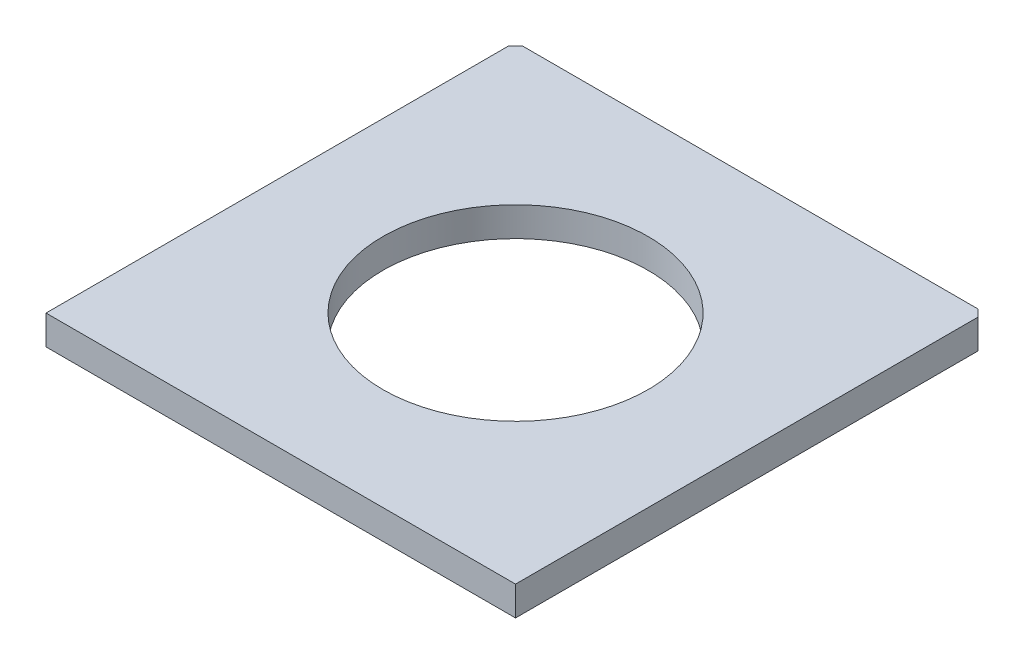
ISO-10303-21;
HEADER;
FILE_DESCRIPTION(('STEP AP214'),'2;1');
FILE_NAME('part.step','',(''),(''),'','','');
FILE_SCHEMA(('AUTOMOTIVE_DESIGN { 1 0 10303 214 1 1 1 1 }'));
ENDSEC;
DATA;
#1=APPLICATION_CONTEXT('core data for automotive mechanical design processes');
#2=APPLICATION_PROTOCOL_DEFINITION('international standard','automotive_design',2000,#1);
#3=PRODUCT_CONTEXT('',#1,'mechanical');
#4=PRODUCT('Part','Part','',(#3));
#5=PRODUCT_RELATED_PRODUCT_CATEGORY('part','',(#4));
#6=PRODUCT_DEFINITION_FORMATION('','',#4);
#7=PRODUCT_DEFINITION_CONTEXT('part definition',#1,'design');
#8=PRODUCT_DEFINITION('design','',#6,#7);
#9=PRODUCT_DEFINITION_SHAPE('','',#8);
#10=(LENGTH_UNIT() NAMED_UNIT(*) SI_UNIT(.MILLI.,.METRE.));
#11=(NAMED_UNIT(*) PLANE_ANGLE_UNIT() SI_UNIT($,.RADIAN.));
#12=(NAMED_UNIT(*) SI_UNIT($,.STERADIAN.) SOLID_ANGLE_UNIT());
#13=UNCERTAINTY_MEASURE_WITH_UNIT(LENGTH_MEASURE(1.E-05),#10,'distance_accuracy_value','');
#14=(GEOMETRIC_REPRESENTATION_CONTEXT(3) GLOBAL_UNCERTAINTY_ASSIGNED_CONTEXT((#13)) GLOBAL_UNIT_ASSIGNED_CONTEXT((#10,
#11,#12)) REPRESENTATION_CONTEXT('',''));
#15=CARTESIAN_POINT('',(0.,0.,0.));
#16=DIRECTION('',(0.,0.,1.));
#17=DIRECTION('',(1.,0.,0.));
#18=AXIS2_PLACEMENT_3D('',#15,#16,#17);
#19=CARTESIAN_POINT('',(25.4,3.175,25.4));
#20=DIRECTION('',(-1.,0.,0.));
#21=DIRECTION('',(0.,0.,1.));
#22=AXIS2_PLACEMENT_3D('',#19,#20,#21);
#23=PLANE('',#22);
#24=DIRECTION('',(0.,0.,-1.));
#25=VECTOR('',#24,1.);
#26=CARTESIAN_POINT('',(25.4,0.,25.4));
#27=LINE('',#26,#25);
#28=CARTESIAN_POINT('',(25.4,0.,25.4));
#29=VERTEX_POINT('',#28);
#30=CARTESIAN_POINT('',(25.4,0.,-24.638));
#31=VERTEX_POINT('',#30);
#32=EDGE_CURVE('E109',#29,#31,#27,.T.);
#33=ORIENTED_EDGE('',*,*,#32,.T.);
#34=DIRECTION('',(0.,1.,0.));
#35=VECTOR('',#34,1.);
#36=CARTESIAN_POINT('',(25.4,0.,-24.638));
#37=LINE('',#36,#35);
#38=CARTESIAN_POINT('',(25.4,3.175,-24.638));
#39=VERTEX_POINT('',#38);
#40=EDGE_CURVE('E55',#31,#39,#37,.T.);
#41=ORIENTED_EDGE('',*,*,#40,.T.);
#42=DIRECTION('',(0.,0.,-1.));
#43=VECTOR('',#42,1.);
#44=CARTESIAN_POINT('',(25.4,3.175,25.4));
#45=LINE('',#44,#43);
#46=CARTESIAN_POINT('',(25.4,3.175,25.4));
#47=VERTEX_POINT('',#46);
#48=EDGE_CURVE('E107',#47,#39,#45,.T.);
#49=ORIENTED_EDGE('',*,*,#48,.F.);
#50=DIRECTION('',(0.,-1.,0.));
#51=VECTOR('',#50,1.);
#52=CARTESIAN_POINT('',(25.4,3.175,25.4));
#53=LINE('',#52,#51);
#54=EDGE_CURVE('E40',#47,#29,#53,.T.);
#55=ORIENTED_EDGE('',*,*,#54,.T.);
#56=EDGE_LOOP('',(#33,#41,#49,#55));
#57=FACE_BOUND('',#56,.T.);
#58=ADVANCED_FACE('F33',(#57),#23,.F.);
#59=CARTESIAN_POINT('',(-25.4,3.175,-25.4));
#60=DIRECTION('',(0.,0.,1.));
#61=DIRECTION('',(1.,0.,0.));
#62=AXIS2_PLACEMENT_3D('',#59,#60,#61);
#63=PLANE('',#62);
#64=DIRECTION('',(-1.,0.,0.));
#65=VECTOR('',#64,1.);
#66=CARTESIAN_POINT('',(-25.4,0.,-25.4));
#67=LINE('',#66,#65);
#68=CARTESIAN_POINT('',(24.638,0.,-25.4));
#69=VERTEX_POINT('',#68);
#70=CARTESIAN_POINT('',(-24.638,0.,-25.4));
#71=VERTEX_POINT('',#70);
#72=EDGE_CURVE('E105',#69,#71,#67,.T.);
#73=ORIENTED_EDGE('',*,*,#72,.T.);
#74=DIRECTION('',(0.,1.,0.));
#75=VECTOR('',#74,1.);
#76=CARTESIAN_POINT('',(-24.638,0.,-25.4));
#77=LINE('',#76,#75);
#78=CARTESIAN_POINT('',(-24.638,3.175,-25.4));
#79=VERTEX_POINT('',#78);
#80=EDGE_CURVE('E47',#71,#79,#77,.T.);
#81=ORIENTED_EDGE('',*,*,#80,.T.);
#82=DIRECTION('',(-1.,0.,0.));
#83=VECTOR('',#82,1.);
#84=CARTESIAN_POINT('',(-25.4,3.175,-25.4));
#85=LINE('',#84,#83);
#86=CARTESIAN_POINT('',(24.638,3.175,-25.4));
#87=VERTEX_POINT('',#86);
#88=EDGE_CURVE('E122',#87,#79,#85,.T.);
#89=ORIENTED_EDGE('',*,*,#88,.F.);
#90=DIRECTION('',(0.,1.,0.));
#91=VECTOR('',#90,1.);
#92=CARTESIAN_POINT('',(24.638,0.,-25.4));
#93=LINE('',#92,#91);
#94=EDGE_CURVE('E133',#69,#87,#93,.T.);
#95=ORIENTED_EDGE('',*,*,#94,.F.);
#96=EDGE_LOOP('',(#73,#81,#89,#95));
#97=FACE_BOUND('',#96,.T.);
#98=ADVANCED_FACE('F143',(#97),#63,.F.);
#99=CARTESIAN_POINT('',(-25.4,3.175,25.4));
#100=DIRECTION('',(1.,0.,0.));
#101=DIRECTION('',(0.,0.,-1.));
#102=AXIS2_PLACEMENT_3D('',#99,#100,#101);
#103=PLANE('',#102);
#104=DIRECTION('',(0.,0.,1.));
#105=VECTOR('',#104,1.);
#106=CARTESIAN_POINT('',(-25.4,3.175,25.4));
#107=LINE('',#106,#105);
#108=CARTESIAN_POINT('',(-25.4,3.175,-24.638));
#109=VERTEX_POINT('',#108);
#110=CARTESIAN_POINT('',(-25.4,3.175,25.4));
#111=VERTEX_POINT('',#110);
#112=EDGE_CURVE('E98',#109,#111,#107,.T.);
#113=ORIENTED_EDGE('',*,*,#112,.F.);
#114=DIRECTION('',(0.,1.,0.));
#115=VECTOR('',#114,1.);
#116=CARTESIAN_POINT('',(-25.4,0.,-24.638));
#117=LINE('',#116,#115);
#118=CARTESIAN_POINT('',(-25.4,0.,-24.638));
#119=VERTEX_POINT('',#118);
#120=EDGE_CURVE('E85',#119,#109,#117,.T.);
#121=ORIENTED_EDGE('',*,*,#120,.F.);
#122=DIRECTION('',(0.,0.,1.));
#123=VECTOR('',#122,1.);
#124=CARTESIAN_POINT('',(-25.4,0.,25.4));
#125=LINE('',#124,#123);
#126=CARTESIAN_POINT('',(-25.4,0.,25.4));
#127=VERTEX_POINT('',#126);
#128=EDGE_CURVE('E97',#119,#127,#125,.T.);
#129=ORIENTED_EDGE('',*,*,#128,.T.);
#130=DIRECTION('',(0.,-1.,0.));
#131=VECTOR('',#130,1.);
#132=CARTESIAN_POINT('',(-25.4,3.175,25.4));
#133=LINE('',#132,#131);
#134=EDGE_CURVE('E11',#111,#127,#133,.T.);
#135=ORIENTED_EDGE('',*,*,#134,.F.);
#136=EDGE_LOOP('',(#113,#121,#129,#135));
#137=FACE_BOUND('',#136,.T.);
#138=ADVANCED_FACE('F95',(#137),#103,.F.);
#139=CARTESIAN_POINT('',(-25.4,3.175,25.4));
#140=DIRECTION('',(0.,0.,-1.));
#141=DIRECTION('',(-1.,0.,0.));
#142=AXIS2_PLACEMENT_3D('',#139,#140,#141);
#143=PLANE('',#142);
#144=DIRECTION('',(1.,0.,0.));
#145=VECTOR('',#144,1.);
#146=CARTESIAN_POINT('',(-25.4,0.,25.4));
#147=LINE('',#146,#145);
#148=EDGE_CURVE('E104',#127,#29,#147,.T.);
#149=ORIENTED_EDGE('',*,*,#148,.T.);
#150=ORIENTED_EDGE('',*,*,#54,.F.);
#151=DIRECTION('',(1.,0.,0.));
#152=VECTOR('',#151,1.);
#153=CARTESIAN_POINT('',(-25.4,3.175,25.4));
#154=LINE('',#153,#152);
#155=EDGE_CURVE('E113',#111,#47,#154,.T.);
#156=ORIENTED_EDGE('',*,*,#155,.F.);
#157=ORIENTED_EDGE('',*,*,#134,.T.);
#158=EDGE_LOOP('',(#149,#150,#156,#157));
#159=FACE_BOUND('',#158,.T.);
#160=ADVANCED_FACE('F167',(#159),#143,.F.);
#161=CARTESIAN_POINT('',(0.,3.175,0.));
#162=DIRECTION('',(0.,-1.,0.));
#163=DIRECTION('',(0.,0.,-1.));
#164=AXIS2_PLACEMENT_3D('',#161,#162,#163);
#165=PLANE('',#164);
#166=CARTESIAN_POINT('',(0.,3.175,0.));
#167=DIRECTION('',(0.,1.,0.));
#168=DIRECTION('',(0.,0.,1.));
#169=AXIS2_PLACEMENT_3D('',#166,#167,#168);
#170=CIRCLE('',#169,14.35);
#171=CARTESIAN_POINT('',(0.,3.175,14.35));
#172=VERTEX_POINT('',#171);
#173=EDGE_CURVE('E127',#172,#172,#170,.T.);
#174=ORIENTED_EDGE('',*,*,#173,.F.);
#175=EDGE_LOOP('',(#174));
#176=FACE_BOUND('',#175,.T.);
#177=ORIENTED_EDGE('',*,*,#88,.T.);
#178=DIRECTION('',(0.707106781186543,0.,-0.707106781186552));
#179=VECTOR('',#178,1.);
#180=CARTESIAN_POINT('',(-24.638,3.175,-25.4));
#181=LINE('',#180,#179);
#182=EDGE_CURVE('E91',#109,#79,#181,.T.);
#183=ORIENTED_EDGE('',*,*,#182,.F.);
#184=ORIENTED_EDGE('',*,*,#112,.T.);
#185=ORIENTED_EDGE('',*,*,#155,.T.);
#186=ORIENTED_EDGE('',*,*,#48,.T.);
#187=DIRECTION('',(0.707106781186554,0.,0.707106781186541));
#188=VECTOR('',#187,1.);
#189=CARTESIAN_POINT('',(25.4,3.175,-24.638));
#190=LINE('',#189,#188);
#191=EDGE_CURVE('E140',#87,#39,#190,.T.);
#192=ORIENTED_EDGE('',*,*,#191,.F.);
#193=EDGE_LOOP('',(#177,#183,#184,#185,#186,#192));
#194=FACE_BOUND('',#193,.T.);
#195=ADVANCED_FACE('F139',(#176,#194),#165,.F.);
#196=CARTESIAN_POINT('',(0.,0.,0.));
#197=DIRECTION('',(0.,-1.,0.));
#198=DIRECTION('',(0.,0.,-1.));
#199=AXIS2_PLACEMENT_3D('',#196,#197,#198);
#200=PLANE('',#199);
#201=DIRECTION('',(0.707106781186543,0.,-0.707106781186552));
#202=VECTOR('',#201,1.);
#203=CARTESIAN_POINT('',(-24.638,0.,-25.4));
#204=LINE('',#203,#202);
#205=EDGE_CURVE('E82',#119,#71,#204,.T.);
#206=ORIENTED_EDGE('',*,*,#205,.T.);
#207=ORIENTED_EDGE('',*,*,#72,.F.);
#208=DIRECTION('',(0.707106781186554,0.,0.707106781186541));
#209=VECTOR('',#208,1.);
#210=CARTESIAN_POINT('',(25.4,0.,-24.638));
#211=LINE('',#210,#209);
#212=EDGE_CURVE('E147',#69,#31,#211,.T.);
#213=ORIENTED_EDGE('',*,*,#212,.T.);
#214=ORIENTED_EDGE('',*,*,#32,.F.);
#215=ORIENTED_EDGE('',*,*,#148,.F.);
#216=ORIENTED_EDGE('',*,*,#128,.F.);
#217=EDGE_LOOP('',(#206,#207,#213,#214,#215,#216));
#218=FACE_BOUND('',#217,.T.);
#219=CARTESIAN_POINT('',(0.,0.,0.));
#220=DIRECTION('',(0.,1.,0.));
#221=DIRECTION('',(0.,0.,1.));
#222=AXIS2_PLACEMENT_3D('',#219,#220,#221);
#223=CIRCLE('',#222,14.35);
#224=CARTESIAN_POINT('',(0.,0.,14.35));
#225=VERTEX_POINT('',#224);
#226=EDGE_CURVE('E125',#225,#225,#223,.T.);
#227=ORIENTED_EDGE('',*,*,#226,.T.);
#228=EDGE_LOOP('',(#227));
#229=FACE_BOUND('',#228,.T.);
#230=ADVANCED_FACE('F101',(#218,#229),#200,.T.);
#231=CARTESIAN_POINT('',(0.,0.,0.));
#232=DIRECTION('',(0.,1.,0.));
#233=DIRECTION('',(0.,0.,1.));
#234=AXIS2_PLACEMENT_3D('',#231,#232,#233);
#235=CYLINDRICAL_SURFACE('',#234,14.35);
#236=ORIENTED_EDGE('',*,*,#226,.F.);
#237=EDGE_LOOP('',(#236));
#238=FACE_BOUND('',#237,.T.);
#239=ORIENTED_EDGE('',*,*,#173,.T.);
#240=EDGE_LOOP('',(#239));
#241=FACE_BOUND('',#240,.T.);
#242=ADVANCED_FACE('F151',(#238,#241),#235,.F.);
#243=CARTESIAN_POINT('',(25.4,0.,-24.638));
#244=DIRECTION('',(-0.707106781186541,0.,0.707106781186554));
#245=DIRECTION('',(0.707106781186554,0.,0.707106781186541));
#246=AXIS2_PLACEMENT_3D('',#243,#244,#245);
#247=PLANE('',#246);
#248=ORIENTED_EDGE('',*,*,#191,.T.);
#249=ORIENTED_EDGE('',*,*,#40,.F.);
#250=ORIENTED_EDGE('',*,*,#212,.F.);
#251=ORIENTED_EDGE('',*,*,#94,.T.);
#252=EDGE_LOOP('',(#248,#249,#250,#251));
#253=FACE_BOUND('',#252,.T.);
#254=ADVANCED_FACE('F149',(#253),#247,.F.);
#255=CARTESIAN_POINT('',(-24.638,0.,-25.4));
#256=DIRECTION('',(0.707106781186552,0.,0.707106781186543));
#257=DIRECTION('',(0.707106781186543,0.,-0.707106781186552));
#258=AXIS2_PLACEMENT_3D('',#255,#256,#257);
#259=PLANE('',#258);
#260=ORIENTED_EDGE('',*,*,#182,.T.);
#261=ORIENTED_EDGE('',*,*,#80,.F.);
#262=ORIENTED_EDGE('',*,*,#205,.F.);
#263=ORIENTED_EDGE('',*,*,#120,.T.);
#264=EDGE_LOOP('',(#260,#261,#262,#263));
#265=FACE_BOUND('',#264,.T.);
#266=ADVANCED_FACE('F84',(#265),#259,.F.);
#267=CLOSED_SHELL('',(#58,#98,#138,#160,#195,#230,#242,#254,#266));
#268=MANIFOLD_SOLID_BREP('B2',#267);
#269=ADVANCED_BREP_SHAPE_REPRESENTATION('',(#18,#268),#14);
#270=SHAPE_DEFINITION_REPRESENTATION(#9,#269);
ENDSEC;
END-ISO-10303-21;
